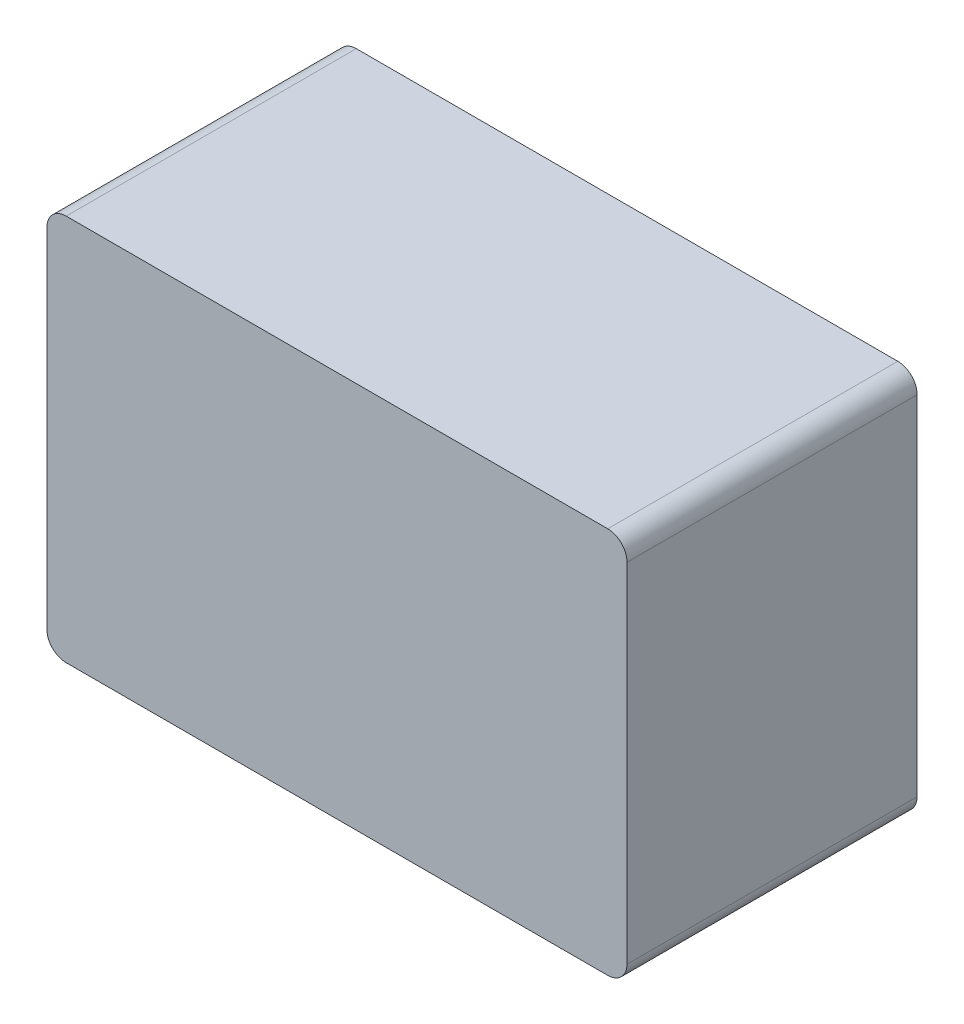
ISO-10303-21;
HEADER;
FILE_DESCRIPTION(('STEP AP214'),'2;1');
FILE_NAME('part.step','',(''),(''),'','','');
FILE_SCHEMA(('AUTOMOTIVE_DESIGN { 1 0 10303 214 1 1 1 1 }'));
ENDSEC;
DATA;
#1=APPLICATION_CONTEXT('core data for automotive mechanical design processes');
#2=APPLICATION_PROTOCOL_DEFINITION('international standard','automotive_design',2000,#1);
#3=PRODUCT_CONTEXT('',#1,'mechanical');
#4=PRODUCT('Part','Part','',(#3));
#5=PRODUCT_RELATED_PRODUCT_CATEGORY('part','',(#4));
#6=PRODUCT_DEFINITION_FORMATION('','',#4);
#7=PRODUCT_DEFINITION_CONTEXT('part definition',#1,'design');
#8=PRODUCT_DEFINITION('design','',#6,#7);
#9=PRODUCT_DEFINITION_SHAPE('','',#8);
#10=(LENGTH_UNIT() NAMED_UNIT(*) SI_UNIT(.MILLI.,.METRE.));
#11=(NAMED_UNIT(*) PLANE_ANGLE_UNIT() SI_UNIT($,.RADIAN.));
#12=(NAMED_UNIT(*) SI_UNIT($,.STERADIAN.) SOLID_ANGLE_UNIT());
#13=UNCERTAINTY_MEASURE_WITH_UNIT(LENGTH_MEASURE(1.E-05),#10,'distance_accuracy_value','');
#14=(GEOMETRIC_REPRESENTATION_CONTEXT(3) GLOBAL_UNCERTAINTY_ASSIGNED_CONTEXT((#13)) GLOBAL_UNIT_ASSIGNED_CONTEXT((#10,
#11,#12)) REPRESENTATION_CONTEXT('',''));
#15=CARTESIAN_POINT('',(0.,0.,0.));
#16=DIRECTION('',(0.,0.,1.));
#17=DIRECTION('',(1.,0.,0.));
#18=AXIS2_PLACEMENT_3D('',#15,#16,#17);
#19=CARTESIAN_POINT('',(0.,0.,150.));
#20=DIRECTION('',(1.,0.,0.));
#21=DIRECTION('',(0.,0.,-1.));
#22=AXIS2_PLACEMENT_3D('',#19,#20,#21);
#23=PLANE('',#22);
#24=DIRECTION('',(0.,-1.,0.));
#25=VECTOR('',#24,1.);
#26=CARTESIAN_POINT('',(0.,0.,0.));
#27=LINE('',#26,#25);
#28=CARTESIAN_POINT('',(0.,190.,0.));
#29=VERTEX_POINT('',#28);
#30=CARTESIAN_POINT('',(0.,10.,0.));
#31=VERTEX_POINT('',#30);
#32=EDGE_CURVE('E125',#29,#31,#27,.T.);
#33=ORIENTED_EDGE('',*,*,#32,.T.);
#34=DIRECTION('',(0.,0.,-1.));
#35=VECTOR('',#34,1.);
#36=CARTESIAN_POINT('',(0.,10.,150.));
#37=LINE('',#36,#35);
#38=CARTESIAN_POINT('',(0.,10.,150.));
#39=VERTEX_POINT('',#38);
#40=EDGE_CURVE('E103',#31,#39,#37,.F.);
#41=ORIENTED_EDGE('',*,*,#40,.T.);
#42=DIRECTION('',(0.,-1.,0.));
#43=VECTOR('',#42,1.);
#44=CARTESIAN_POINT('',(0.,0.,150.));
#45=LINE('',#44,#43);
#46=CARTESIAN_POINT('',(0.,190.,150.));
#47=VERTEX_POINT('',#46);
#48=EDGE_CURVE('E134',#47,#39,#45,.T.);
#49=ORIENTED_EDGE('',*,*,#48,.F.);
#50=DIRECTION('',(0.,0.,-1.));
#51=VECTOR('',#50,1.);
#52=CARTESIAN_POINT('',(0.,190.,150.));
#53=LINE('',#52,#51);
#54=EDGE_CURVE('E108',#47,#29,#53,.T.);
#55=ORIENTED_EDGE('',*,*,#54,.T.);
#56=EDGE_LOOP('',(#33,#41,#49,#55));
#57=FACE_BOUND('',#56,.T.);
#58=ADVANCED_FACE('F32',(#57),#23,.F.);
#59=CARTESIAN_POINT('',(0.,0.,150.));
#60=DIRECTION('',(0.,1.,0.));
#61=DIRECTION('',(0.,0.,1.));
#62=AXIS2_PLACEMENT_3D('',#59,#60,#61);
#63=PLANE('',#62);
#64=DIRECTION('',(1.,0.,0.));
#65=VECTOR('',#64,1.);
#66=CARTESIAN_POINT('',(0.,0.,150.));
#67=LINE('',#66,#65);
#68=CARTESIAN_POINT('',(10.,0.,150.));
#69=VERTEX_POINT('',#68);
#70=CARTESIAN_POINT('',(290.,0.,150.));
#71=VERTEX_POINT('',#70);
#72=EDGE_CURVE('E118',#69,#71,#67,.T.);
#73=ORIENTED_EDGE('',*,*,#72,.F.);
#74=DIRECTION('',(0.,0.,-1.));
#75=VECTOR('',#74,1.);
#76=CARTESIAN_POINT('',(10.,0.,150.));
#77=LINE('',#76,#75);
#78=CARTESIAN_POINT('',(10.,0.,0.));
#79=VERTEX_POINT('',#78);
#80=EDGE_CURVE('E102',#69,#79,#77,.T.);
#81=ORIENTED_EDGE('',*,*,#80,.T.);
#82=DIRECTION('',(1.,0.,0.));
#83=VECTOR('',#82,1.);
#84=CARTESIAN_POINT('',(0.,0.,0.));
#85=LINE('',#84,#83);
#86=CARTESIAN_POINT('',(290.,0.,0.));
#87=VERTEX_POINT('',#86);
#88=EDGE_CURVE('E115',#79,#87,#85,.T.);
#89=ORIENTED_EDGE('',*,*,#88,.T.);
#90=DIRECTION('',(0.,0.,-1.));
#91=VECTOR('',#90,1.);
#92=CARTESIAN_POINT('',(290.,0.,150.));
#93=LINE('',#92,#91);
#94=EDGE_CURVE('E120',#87,#71,#93,.F.);
#95=ORIENTED_EDGE('',*,*,#94,.T.);
#96=EDGE_LOOP('',(#73,#81,#89,#95));
#97=FACE_BOUND('',#96,.T.);
#98=ADVANCED_FACE('F114',(#97),#63,.F.);
#99=CARTESIAN_POINT('',(300.,0.,150.));
#100=DIRECTION('',(-1.,0.,0.));
#101=DIRECTION('',(0.,0.,1.));
#102=AXIS2_PLACEMENT_3D('',#99,#100,#101);
#103=PLANE('',#102);
#104=DIRECTION('',(0.,1.,0.));
#105=VECTOR('',#104,1.);
#106=CARTESIAN_POINT('',(300.,0.,150.));
#107=LINE('',#106,#105);
#108=CARTESIAN_POINT('',(300.,10.,150.));
#109=VERTEX_POINT('',#108);
#110=CARTESIAN_POINT('',(300.,190.,150.));
#111=VERTEX_POINT('',#110);
#112=EDGE_CURVE('E160',#109,#111,#107,.T.);
#113=ORIENTED_EDGE('',*,*,#112,.F.);
#114=DIRECTION('',(0.,0.,-1.));
#115=VECTOR('',#114,1.);
#116=CARTESIAN_POINT('',(300.,10.,150.));
#117=LINE('',#116,#115);
#118=CARTESIAN_POINT('',(300.,10.,0.));
#119=VERTEX_POINT('',#118);
#120=EDGE_CURVE('E153',#109,#119,#117,.T.);
#121=ORIENTED_EDGE('',*,*,#120,.T.);
#122=DIRECTION('',(0.,1.,0.));
#123=VECTOR('',#122,1.);
#124=CARTESIAN_POINT('',(300.,0.,0.));
#125=LINE('',#124,#123);
#126=CARTESIAN_POINT('',(300.,190.,0.));
#127=VERTEX_POINT('',#126);
#128=EDGE_CURVE('E124',#119,#127,#125,.T.);
#129=ORIENTED_EDGE('',*,*,#128,.T.);
#130=DIRECTION('',(0.,0.,-1.));
#131=VECTOR('',#130,1.);
#132=CARTESIAN_POINT('',(300.,190.,150.));
#133=LINE('',#132,#131);
#134=EDGE_CURVE('E151',#127,#111,#133,.F.);
#135=ORIENTED_EDGE('',*,*,#134,.T.);
#136=EDGE_LOOP('',(#113,#121,#129,#135));
#137=FACE_BOUND('',#136,.T.);
#138=ADVANCED_FACE('F158',(#137),#103,.F.);
#139=CARTESIAN_POINT('',(0.,200.,150.));
#140=DIRECTION('',(0.,-1.,0.));
#141=DIRECTION('',(0.,0.,-1.));
#142=AXIS2_PLACEMENT_3D('',#139,#140,#141);
#143=PLANE('',#142);
#144=DIRECTION('',(-1.,0.,0.));
#145=VECTOR('',#144,1.);
#146=CARTESIAN_POINT('',(0.,200.,150.));
#147=LINE('',#146,#145);
#148=CARTESIAN_POINT('',(290.,200.,150.));
#149=VERTEX_POINT('',#148);
#150=CARTESIAN_POINT('',(10.,200.,150.));
#151=VERTEX_POINT('',#150);
#152=EDGE_CURVE('E135',#149,#151,#147,.T.);
#153=ORIENTED_EDGE('',*,*,#152,.F.);
#154=DIRECTION('',(0.,0.,-1.));
#155=VECTOR('',#154,1.);
#156=CARTESIAN_POINT('',(290.,200.,150.));
#157=LINE('',#156,#155);
#158=CARTESIAN_POINT('',(290.,200.,0.));
#159=VERTEX_POINT('',#158);
#160=EDGE_CURVE('E11',#149,#159,#157,.T.);
#161=ORIENTED_EDGE('',*,*,#160,.T.);
#162=DIRECTION('',(-1.,0.,0.));
#163=VECTOR('',#162,1.);
#164=CARTESIAN_POINT('',(0.,200.,0.));
#165=LINE('',#164,#163);
#166=CARTESIAN_POINT('',(10.,200.,0.));
#167=VERTEX_POINT('',#166);
#168=EDGE_CURVE('E128',#159,#167,#165,.T.);
#169=ORIENTED_EDGE('',*,*,#168,.T.);
#170=DIRECTION('',(0.,0.,-1.));
#171=VECTOR('',#170,1.);
#172=CARTESIAN_POINT('',(10.,200.,150.));
#173=LINE('',#172,#171);
#174=EDGE_CURVE('E40',#167,#151,#173,.F.);
#175=ORIENTED_EDGE('',*,*,#174,.T.);
#176=EDGE_LOOP('',(#153,#161,#169,#175));
#177=FACE_BOUND('',#176,.T.);
#178=ADVANCED_FACE('F167',(#177),#143,.F.);
#179=CARTESIAN_POINT('',(0.,0.,150.));
#180=DIRECTION('',(0.,0.,-1.));
#181=DIRECTION('',(-1.,0.,0.));
#182=AXIS2_PLACEMENT_3D('',#179,#180,#181);
#183=PLANE('',#182);
#184=ORIENTED_EDGE('',*,*,#48,.T.);
#185=CARTESIAN_POINT('',(10.,10.,150.));
#186=DIRECTION('',(0.,0.,-1.));
#187=DIRECTION('',(-1.,0.,0.));
#188=AXIS2_PLACEMENT_3D('',#185,#186,#187);
#189=CIRCLE('',#188,10.);
#190=EDGE_CURVE('E149',#39,#69,#189,.F.);
#191=ORIENTED_EDGE('',*,*,#190,.T.);
#192=ORIENTED_EDGE('',*,*,#72,.T.);
#193=CARTESIAN_POINT('',(290.,10.,150.));
#194=DIRECTION('',(0.,0.,-1.));
#195=DIRECTION('',(-1.,0.,0.));
#196=AXIS2_PLACEMENT_3D('',#193,#194,#195);
#197=CIRCLE('',#196,10.);
#198=EDGE_CURVE('E147',#71,#109,#197,.F.);
#199=ORIENTED_EDGE('',*,*,#198,.T.);
#200=ORIENTED_EDGE('',*,*,#112,.T.);
#201=CARTESIAN_POINT('',(290.,190.,150.));
#202=DIRECTION('',(0.,0.,-1.));
#203=DIRECTION('',(-1.,0.,0.));
#204=AXIS2_PLACEMENT_3D('',#201,#202,#203);
#205=CIRCLE('',#204,10.);
#206=EDGE_CURVE('E53',#111,#149,#205,.F.);
#207=ORIENTED_EDGE('',*,*,#206,.T.);
#208=ORIENTED_EDGE('',*,*,#152,.T.);
#209=CARTESIAN_POINT('',(10.,190.,150.));
#210=DIRECTION('',(0.,0.,-1.));
#211=DIRECTION('',(-1.,0.,0.));
#212=AXIS2_PLACEMENT_3D('',#209,#210,#211);
#213=CIRCLE('',#212,10.);
#214=EDGE_CURVE('E144',#151,#47,#213,.F.);
#215=ORIENTED_EDGE('',*,*,#214,.T.);
#216=EDGE_LOOP('',(#184,#191,#192,#199,#200,#207,#208,#215));
#217=FACE_BOUND('',#216,.T.);
#218=ADVANCED_FACE('F174',(#217),#183,.F.);
#219=CARTESIAN_POINT('',(0.,0.,0.));
#220=DIRECTION('',(0.,0.,-1.));
#221=DIRECTION('',(-1.,0.,0.));
#222=AXIS2_PLACEMENT_3D('',#219,#220,#221);
#223=PLANE('',#222);
#224=ORIENTED_EDGE('',*,*,#88,.F.);
#225=CARTESIAN_POINT('',(10.,10.,0.));
#226=DIRECTION('',(0.,0.,-1.));
#227=DIRECTION('',(-1.,0.,0.));
#228=AXIS2_PLACEMENT_3D('',#225,#226,#227);
#229=CIRCLE('',#228,10.);
#230=EDGE_CURVE('E98',#79,#31,#229,.T.);
#231=ORIENTED_EDGE('',*,*,#230,.T.);
#232=ORIENTED_EDGE('',*,*,#32,.F.);
#233=CARTESIAN_POINT('',(10.,190.,0.));
#234=DIRECTION('',(0.,0.,-1.));
#235=DIRECTION('',(-1.,0.,0.));
#236=AXIS2_PLACEMENT_3D('',#233,#234,#235);
#237=CIRCLE('',#236,10.);
#238=EDGE_CURVE('E119',#29,#167,#237,.T.);
#239=ORIENTED_EDGE('',*,*,#238,.T.);
#240=ORIENTED_EDGE('',*,*,#168,.F.);
#241=CARTESIAN_POINT('',(290.,190.,0.));
#242=DIRECTION('',(0.,0.,-1.));
#243=DIRECTION('',(-1.,0.,0.));
#244=AXIS2_PLACEMENT_3D('',#241,#242,#243);
#245=CIRCLE('',#244,10.);
#246=EDGE_CURVE('E138',#159,#127,#245,.T.);
#247=ORIENTED_EDGE('',*,*,#246,.T.);
#248=ORIENTED_EDGE('',*,*,#128,.F.);
#249=CARTESIAN_POINT('',(290.,10.,0.));
#250=DIRECTION('',(0.,0.,-1.));
#251=DIRECTION('',(-1.,0.,0.));
#252=AXIS2_PLACEMENT_3D('',#249,#250,#251);
#253=CIRCLE('',#252,10.);
#254=EDGE_CURVE('E109',#119,#87,#253,.T.);
#255=ORIENTED_EDGE('',*,*,#254,.T.);
#256=EDGE_LOOP('',(#224,#231,#232,#239,#240,#247,#248,#255));
#257=FACE_BOUND('',#256,.T.);
#258=ADVANCED_FACE('F122',(#257),#223,.T.);
#259=CARTESIAN_POINT('',(10.,10.,150.));
#260=DIRECTION('',(0.,0.,-1.));
#261=DIRECTION('',(-1.,0.,0.));
#262=AXIS2_PLACEMENT_3D('',#259,#260,#261);
#263=CYLINDRICAL_SURFACE('',#262,10.);
#264=ORIENTED_EDGE('',*,*,#190,.F.);
#265=ORIENTED_EDGE('',*,*,#40,.F.);
#266=ORIENTED_EDGE('',*,*,#230,.F.);
#267=ORIENTED_EDGE('',*,*,#80,.F.);
#268=EDGE_LOOP('',(#264,#265,#266,#267));
#269=FACE_BOUND('',#268,.T.);
#270=ADVANCED_FACE('F101',(#269),#263,.T.);
#271=CARTESIAN_POINT('',(290.,10.,150.));
#272=DIRECTION('',(0.,0.,-1.));
#273=DIRECTION('',(-1.,0.,0.));
#274=AXIS2_PLACEMENT_3D('',#271,#272,#273);
#275=CYLINDRICAL_SURFACE('',#274,10.);
#276=ORIENTED_EDGE('',*,*,#198,.F.);
#277=ORIENTED_EDGE('',*,*,#94,.F.);
#278=ORIENTED_EDGE('',*,*,#254,.F.);
#279=ORIENTED_EDGE('',*,*,#120,.F.);
#280=EDGE_LOOP('',(#276,#277,#278,#279));
#281=FACE_BOUND('',#280,.T.);
#282=ADVANCED_FACE('F182',(#281),#275,.T.);
#283=CARTESIAN_POINT('',(290.,190.,150.));
#284=DIRECTION('',(0.,0.,-1.));
#285=DIRECTION('',(-1.,0.,0.));
#286=AXIS2_PLACEMENT_3D('',#283,#284,#285);
#287=CYLINDRICAL_SURFACE('',#286,10.);
#288=ORIENTED_EDGE('',*,*,#206,.F.);
#289=ORIENTED_EDGE('',*,*,#134,.F.);
#290=ORIENTED_EDGE('',*,*,#246,.F.);
#291=ORIENTED_EDGE('',*,*,#160,.F.);
#292=EDGE_LOOP('',(#288,#289,#290,#291));
#293=FACE_BOUND('',#292,.T.);
#294=ADVANCED_FACE('F166',(#293),#287,.T.);
#295=CARTESIAN_POINT('',(10.,190.,150.));
#296=DIRECTION('',(0.,0.,-1.));
#297=DIRECTION('',(-1.,0.,0.));
#298=AXIS2_PLACEMENT_3D('',#295,#296,#297);
#299=CYLINDRICAL_SURFACE('',#298,10.);
#300=ORIENTED_EDGE('',*,*,#214,.F.);
#301=ORIENTED_EDGE('',*,*,#174,.F.);
#302=ORIENTED_EDGE('',*,*,#238,.F.);
#303=ORIENTED_EDGE('',*,*,#54,.F.);
#304=EDGE_LOOP('',(#300,#301,#302,#303));
#305=FACE_BOUND('',#304,.T.);
#306=ADVANCED_FACE('F34',(#305),#299,.T.);
#307=CLOSED_SHELL('',(#58,#98,#138,#178,#218,#258,#270,#282,#294,#306));
#308=MANIFOLD_SOLID_BREP('B2',#307);
#309=ADVANCED_BREP_SHAPE_REPRESENTATION('',(#18,#308),#14);
#310=SHAPE_DEFINITION_REPRESENTATION(#9,#309);
ENDSEC;
END-ISO-10303-21;
